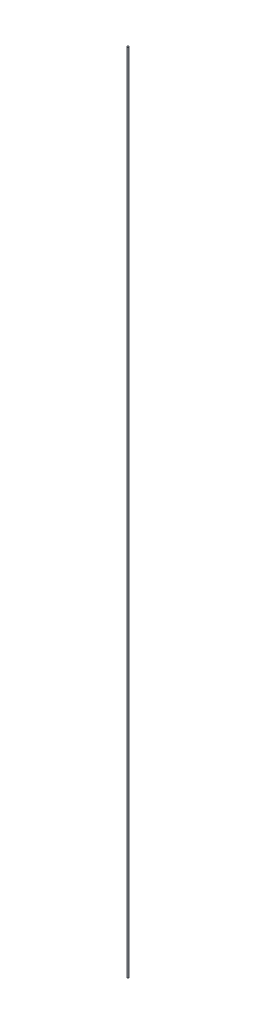
ISO-10303-21;
HEADER;
FILE_DESCRIPTION(('STEP AP214'),'2;1');
FILE_NAME('part.step','',(''),(''),'','','');
FILE_SCHEMA(('AUTOMOTIVE_DESIGN { 1 0 10303 214 1 1 1 1 }'));
ENDSEC;
DATA;
#1=APPLICATION_CONTEXT('core data for automotive mechanical design processes');
#2=APPLICATION_PROTOCOL_DEFINITION('international standard','automotive_design',2000,#1);
#3=PRODUCT_CONTEXT('',#1,'mechanical');
#4=PRODUCT('Part','Part','',(#3));
#5=PRODUCT_RELATED_PRODUCT_CATEGORY('part','',(#4));
#6=PRODUCT_DEFINITION_FORMATION('','',#4);
#7=PRODUCT_DEFINITION_CONTEXT('part definition',#1,'design');
#8=PRODUCT_DEFINITION('design','',#6,#7);
#9=PRODUCT_DEFINITION_SHAPE('','',#8);
#10=(LENGTH_UNIT() NAMED_UNIT(*) SI_UNIT(.MILLI.,.METRE.));
#11=(NAMED_UNIT(*) PLANE_ANGLE_UNIT() SI_UNIT($,.RADIAN.));
#12=(NAMED_UNIT(*) SI_UNIT($,.STERADIAN.) SOLID_ANGLE_UNIT());
#13=UNCERTAINTY_MEASURE_WITH_UNIT(LENGTH_MEASURE(1.E-05),#10,'distance_accuracy_value','');
#14=(GEOMETRIC_REPRESENTATION_CONTEXT(3) GLOBAL_UNCERTAINTY_ASSIGNED_CONTEXT((#13)) GLOBAL_UNIT_ASSIGNED_CONTEXT((#10,
#11,#12)) REPRESENTATION_CONTEXT('',''));
#15=CARTESIAN_POINT('',(0.,0.,0.));
#16=DIRECTION('',(0.,0.,1.));
#17=DIRECTION('',(1.,0.,0.));
#18=AXIS2_PLACEMENT_3D('',#15,#16,#17);
#19=CARTESIAN_POINT('',(0.,1000.,0.));
#20=DIRECTION('',(0.,-1.,0.));
#21=DIRECTION('',(0.,0.,-1.));
#22=AXIS2_PLACEMENT_3D('',#19,#20,#21);
#23=CYLINDRICAL_SURFACE('',#22,0.999999999999999);
#24=CARTESIAN_POINT('',(0.,1000.,0.));
#25=DIRECTION('',(0.,1.,0.));
#26=DIRECTION('',(0.,0.,1.));
#27=AXIS2_PLACEMENT_3D('',#24,#25,#26);
#28=CIRCLE('',#27,0.999999999999999);
#29=CARTESIAN_POINT('',(0.,1000.,0.999999999999999));
#30=VERTEX_POINT('',#29);
#31=EDGE_CURVE('E10',#30,#30,#28,.T.);
#32=ORIENTED_EDGE('',*,*,#31,.F.);
#33=EDGE_LOOP('',(#32));
#34=FACE_BOUND('',#33,.T.);
#35=CARTESIAN_POINT('',(0.,0.,0.));
#36=DIRECTION('',(0.,1.,0.));
#37=DIRECTION('',(0.,0.,1.));
#38=AXIS2_PLACEMENT_3D('',#35,#36,#37);
#39=CIRCLE('',#38,0.999999999999999);
#40=CARTESIAN_POINT('',(0.,0.,0.999999999999999));
#41=VERTEX_POINT('',#40);
#42=EDGE_CURVE('E42',#41,#41,#39,.T.);
#43=ORIENTED_EDGE('',*,*,#42,.T.);
#44=EDGE_LOOP('',(#43));
#45=FACE_BOUND('',#44,.T.);
#46=ADVANCED_FACE('F39',(#34,#45),#23,.T.);
#47=CARTESIAN_POINT('',(0.,1000.,0.));
#48=DIRECTION('',(0.,1.,0.));
#49=DIRECTION('',(0.,0.,1.));
#50=AXIS2_PLACEMENT_3D('',#47,#48,#49);
#51=PLANE('',#50);
#52=ORIENTED_EDGE('',*,*,#31,.T.);
#53=EDGE_LOOP('',(#52));
#54=FACE_BOUND('',#53,.T.);
#55=ADVANCED_FACE('F56',(#54),#51,.T.);
#56=CARTESIAN_POINT('',(0.,0.,0.));
#57=DIRECTION('',(0.,1.,0.));
#58=DIRECTION('',(0.,0.,1.));
#59=AXIS2_PLACEMENT_3D('',#56,#57,#58);
#60=PLANE('',#59);
#61=ORIENTED_EDGE('',*,*,#42,.F.);
#62=EDGE_LOOP('',(#61));
#63=FACE_BOUND('',#62,.T.);
#64=ADVANCED_FACE('F54',(#63),#60,.F.);
#65=CLOSED_SHELL('',(#46,#55,#64));
#66=MANIFOLD_SOLID_BREP('B2',#65);
#67=ADVANCED_BREP_SHAPE_REPRESENTATION('',(#18,#66),#14);
#68=SHAPE_DEFINITION_REPRESENTATION(#9,#67);
ENDSEC;
END-ISO-10303-21;
